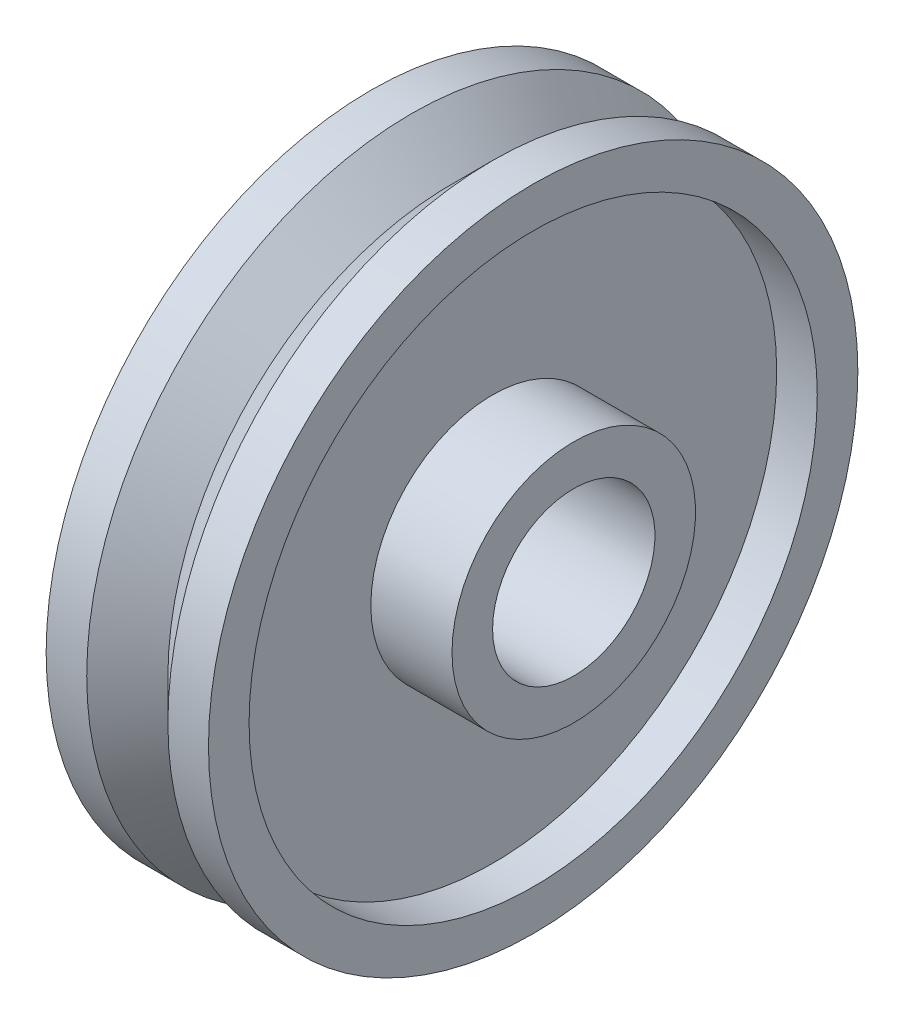
ISO-10303-21;
HEADER;
FILE_DESCRIPTION(('STEP AP214'),'2;1');
FILE_NAME('part.step','',(''),(''),'','','');
FILE_SCHEMA(('AUTOMOTIVE_DESIGN { 1 0 10303 214 1 1 1 1 }'));
ENDSEC;
DATA;
#1=APPLICATION_CONTEXT('core data for automotive mechanical design processes');
#2=APPLICATION_PROTOCOL_DEFINITION('international standard','automotive_design',2000,#1);
#3=PRODUCT_CONTEXT('',#1,'mechanical');
#4=PRODUCT('Part','Part','',(#3));
#5=PRODUCT_RELATED_PRODUCT_CATEGORY('part','',(#4));
#6=PRODUCT_DEFINITION_FORMATION('','',#4);
#7=PRODUCT_DEFINITION_CONTEXT('part definition',#1,'design');
#8=PRODUCT_DEFINITION('design','',#6,#7);
#9=PRODUCT_DEFINITION_SHAPE('','',#8);
#10=(LENGTH_UNIT() NAMED_UNIT(*) SI_UNIT(.MILLI.,.METRE.));
#11=(NAMED_UNIT(*) PLANE_ANGLE_UNIT() SI_UNIT($,.RADIAN.));
#12=(NAMED_UNIT(*) SI_UNIT($,.STERADIAN.) SOLID_ANGLE_UNIT());
#13=UNCERTAINTY_MEASURE_WITH_UNIT(LENGTH_MEASURE(1.E-05),#10,'distance_accuracy_value','');
#14=(GEOMETRIC_REPRESENTATION_CONTEXT(3) GLOBAL_UNCERTAINTY_ASSIGNED_CONTEXT((#13)) GLOBAL_UNIT_ASSIGNED_CONTEXT((#10,
#11,#12)) REPRESENTATION_CONTEXT('',''));
#15=CARTESIAN_POINT('',(0.,0.,0.));
#16=DIRECTION('',(0.,0.,1.));
#17=DIRECTION('',(1.,0.,0.));
#18=AXIS2_PLACEMENT_3D('',#15,#16,#17);
#19=CARTESIAN_POINT('',(19.05,12.7,0.));
#20=DIRECTION('',(-1.,0.,0.));
#21=DIRECTION('',(0.,0.,1.));
#22=AXIS2_PLACEMENT_3D('',#19,#20,#21);
#23=PLANE('',#22);
#24=CARTESIAN_POINT('',(19.05,0.,0.));
#25=DIRECTION('',(-1.,0.,0.));
#26=DIRECTION('',(0.,0.,1.));
#27=AXIS2_PLACEMENT_3D('',#24,#25,#26);
#28=CIRCLE('',#27,19.05);
#29=CARTESIAN_POINT('',(19.05,0.,19.05));
#30=VERTEX_POINT('',#29);
#31=EDGE_CURVE('E10',#30,#30,#28,.T.);
#32=ORIENTED_EDGE('',*,*,#31,.F.);
#33=EDGE_LOOP('',(#32));
#34=FACE_BOUND('',#33,.T.);
#35=CARTESIAN_POINT('',(19.05,0.,0.));
#36=DIRECTION('',(-1.,0.,0.));
#37=DIRECTION('',(0.,0.,1.));
#38=AXIS2_PLACEMENT_3D('',#35,#36,#37);
#39=CIRCLE('',#38,12.7);
#40=CARTESIAN_POINT('',(19.05,0.,12.7));
#41=VERTEX_POINT('',#40);
#42=EDGE_CURVE('E90',#41,#41,#39,.T.);
#43=ORIENTED_EDGE('',*,*,#42,.T.);
#44=EDGE_LOOP('',(#43));
#45=FACE_BOUND('',#44,.T.);
#46=ADVANCED_FACE('F41',(#34,#45),#23,.F.);
#47=CARTESIAN_POINT('',(-487.032527769321,0.,0.));
#48=DIRECTION('',(-1.,0.,0.));
#49=DIRECTION('',(0.,0.,1.));
#50=AXIS2_PLACEMENT_3D('',#47,#48,#49);
#51=CYLINDRICAL_SURFACE('',#50,19.05);
#52=CARTESIAN_POINT('',(6.35000000000002,0.,0.));
#53=DIRECTION('',(-1.,0.,0.));
#54=DIRECTION('',(0.,0.,1.));
#55=AXIS2_PLACEMENT_3D('',#52,#53,#54);
#56=CIRCLE('',#55,19.05);
#57=CARTESIAN_POINT('',(6.35000000000002,0.,19.05));
#58=VERTEX_POINT('',#57);
#59=EDGE_CURVE('E47',#58,#58,#56,.T.);
#60=ORIENTED_EDGE('',*,*,#59,.F.);
#61=EDGE_LOOP('',(#60));
#62=FACE_BOUND('',#61,.T.);
#63=ORIENTED_EDGE('',*,*,#31,.T.);
#64=EDGE_LOOP('',(#63));
#65=FACE_BOUND('',#64,.T.);
#66=ADVANCED_FACE('F169',(#62,#65),#51,.T.);
#67=CARTESIAN_POINT('',(6.35,19.05,0.));
#68=DIRECTION('',(-1.,0.,0.));
#69=DIRECTION('',(0.,0.,1.));
#70=AXIS2_PLACEMENT_3D('',#67,#68,#69);
#71=PLANE('',#70);
#72=CARTESIAN_POINT('',(6.35000000000002,0.,0.));
#73=DIRECTION('',(-1.,0.,0.));
#74=DIRECTION('',(0.,0.,1.));
#75=AXIS2_PLACEMENT_3D('',#72,#73,#74);
#76=CIRCLE('',#75,44.45);
#77=CARTESIAN_POINT('',(6.35000000000002,0.,44.45));
#78=VERTEX_POINT('',#77);
#79=EDGE_CURVE('E51',#78,#78,#76,.T.);
#80=ORIENTED_EDGE('',*,*,#79,.F.);
#81=EDGE_LOOP('',(#80));
#82=FACE_BOUND('',#81,.T.);
#83=ORIENTED_EDGE('',*,*,#59,.T.);
#84=EDGE_LOOP('',(#83));
#85=FACE_BOUND('',#84,.T.);
#86=ADVANCED_FACE('F164',(#82,#85),#71,.F.);
#87=CARTESIAN_POINT('',(-487.032527769321,0.,0.));
#88=DIRECTION('',(-1.,0.,0.));
#89=DIRECTION('',(0.,0.,1.));
#90=AXIS2_PLACEMENT_3D('',#87,#88,#89);
#91=CYLINDRICAL_SURFACE('',#90,44.45);
#92=CARTESIAN_POINT('',(12.7,0.,0.));
#93=DIRECTION('',(-1.,0.,0.));
#94=DIRECTION('',(0.,0.,1.));
#95=AXIS2_PLACEMENT_3D('',#92,#93,#94);
#96=CIRCLE('',#95,44.45);
#97=CARTESIAN_POINT('',(12.7,0.,44.45));
#98=VERTEX_POINT('',#97);
#99=EDGE_CURVE('E55',#98,#98,#96,.T.);
#100=ORIENTED_EDGE('',*,*,#99,.F.);
#101=EDGE_LOOP('',(#100));
#102=FACE_BOUND('',#101,.T.);
#103=ORIENTED_EDGE('',*,*,#79,.T.);
#104=EDGE_LOOP('',(#103));
#105=FACE_BOUND('',#104,.T.);
#106=ADVANCED_FACE('F158',(#102,#105),#91,.F.);
#107=CARTESIAN_POINT('',(12.7,44.45,0.));
#108=DIRECTION('',(-1.,0.,0.));
#109=DIRECTION('',(0.,0.,1.));
#110=AXIS2_PLACEMENT_3D('',#107,#108,#109);
#111=PLANE('',#110);
#112=CARTESIAN_POINT('',(12.7,0.,0.));
#113=DIRECTION('',(-1.,0.,0.));
#114=DIRECTION('',(0.,0.,1.));
#115=AXIS2_PLACEMENT_3D('',#112,#113,#114);
#116=CIRCLE('',#115,50.8);
#117=CARTESIAN_POINT('',(12.7,0.,50.8));
#118=VERTEX_POINT('',#117);
#119=EDGE_CURVE('E60',#118,#118,#116,.T.);
#120=ORIENTED_EDGE('',*,*,#119,.F.);
#121=EDGE_LOOP('',(#120));
#122=FACE_BOUND('',#121,.T.);
#123=ORIENTED_EDGE('',*,*,#99,.T.);
#124=EDGE_LOOP('',(#123));
#125=FACE_BOUND('',#124,.T.);
#126=ADVANCED_FACE('F152',(#122,#125),#111,.F.);
#127=CARTESIAN_POINT('',(-487.032527769321,0.,0.));
#128=DIRECTION('',(-1.,0.,0.));
#129=DIRECTION('',(0.,0.,1.));
#130=AXIS2_PLACEMENT_3D('',#127,#128,#129);
#131=CYLINDRICAL_SURFACE('',#130,50.8);
#132=CARTESIAN_POINT('',(6.34999999999991,0.,0.));
#133=DIRECTION('',(-1.,0.,0.));
#134=DIRECTION('',(0.,0.,1.));
#135=AXIS2_PLACEMENT_3D('',#132,#133,#134);
#136=CIRCLE('',#135,50.8);
#137=CARTESIAN_POINT('',(6.34999999999991,0.,50.8));
#138=VERTEX_POINT('',#137);
#139=EDGE_CURVE('E63',#138,#138,#136,.T.);
#140=ORIENTED_EDGE('',*,*,#139,.F.);
#141=EDGE_LOOP('',(#140));
#142=FACE_BOUND('',#141,.T.);
#143=ORIENTED_EDGE('',*,*,#119,.T.);
#144=EDGE_LOOP('',(#143));
#145=FACE_BOUND('',#144,.T.);
#146=ADVANCED_FACE('F146',(#142,#145),#131,.T.);
#147=CARTESIAN_POINT('',(6.34999999999991,0.,0.));
#148=DIRECTION('',(1.,0.,0.));
#149=DIRECTION('',(0.,0.,-1.));
#150=AXIS2_PLACEMENT_3D('',#147,#148,#149);
#151=CONICAL_SURFACE('',#150,50.8,0.785398163397455);
#152=CARTESIAN_POINT('',(0.,0.,0.));
#153=DIRECTION('',(-1.,0.,0.));
#154=DIRECTION('',(0.,0.,1.));
#155=AXIS2_PLACEMENT_3D('',#152,#153,#154);
#156=CIRCLE('',#155,44.45);
#157=CARTESIAN_POINT('',(0.,0.,44.45));
#158=VERTEX_POINT('',#157);
#159=EDGE_CURVE('E66',#158,#158,#156,.T.);
#160=ORIENTED_EDGE('',*,*,#159,.F.);
#161=EDGE_LOOP('',(#160));
#162=FACE_BOUND('',#161,.T.);
#163=ORIENTED_EDGE('',*,*,#139,.T.);
#164=EDGE_LOOP('',(#163));
#165=FACE_BOUND('',#164,.T.);
#166=ADVANCED_FACE('F140',(#162,#165),#151,.T.);
#167=CARTESIAN_POINT('',(0.,0.,0.));
#168=DIRECTION('',(-1.,0.,0.));
#169=DIRECTION('',(0.,0.,1.));
#170=AXIS2_PLACEMENT_3D('',#167,#168,#169);
#171=CONICAL_SURFACE('',#170,44.45,0.785398163397425);
#172=CARTESIAN_POINT('',(-6.3500000000003,0.,0.));
#173=DIRECTION('',(-1.,0.,0.));
#174=DIRECTION('',(0.,0.,1.));
#175=AXIS2_PLACEMENT_3D('',#172,#173,#174);
#176=CIRCLE('',#175,50.8);
#177=CARTESIAN_POINT('',(-6.3500000000003,0.,50.8));
#178=VERTEX_POINT('',#177);
#179=EDGE_CURVE('E69',#178,#178,#176,.T.);
#180=ORIENTED_EDGE('',*,*,#179,.F.);
#181=EDGE_LOOP('',(#180));
#182=FACE_BOUND('',#181,.T.);
#183=ORIENTED_EDGE('',*,*,#159,.T.);
#184=EDGE_LOOP('',(#183));
#185=FACE_BOUND('',#184,.T.);
#186=ADVANCED_FACE('F134',(#182,#185),#171,.T.);
#187=CARTESIAN_POINT('',(-487.032527769321,0.,0.));
#188=DIRECTION('',(-1.,0.,0.));
#189=DIRECTION('',(0.,0.,1.));
#190=AXIS2_PLACEMENT_3D('',#187,#188,#189);
#191=CYLINDRICAL_SURFACE('',#190,50.8);
#192=CARTESIAN_POINT('',(-12.7000000000003,0.,0.));
#193=DIRECTION('',(-1.,0.,0.));
#194=DIRECTION('',(0.,0.,1.));
#195=AXIS2_PLACEMENT_3D('',#192,#193,#194);
#196=CIRCLE('',#195,50.8);
#197=CARTESIAN_POINT('',(-12.7000000000003,0.,50.8));
#198=VERTEX_POINT('',#197);
#199=EDGE_CURVE('E72',#198,#198,#196,.T.);
#200=ORIENTED_EDGE('',*,*,#199,.F.);
#201=EDGE_LOOP('',(#200));
#202=FACE_BOUND('',#201,.T.);
#203=ORIENTED_EDGE('',*,*,#179,.T.);
#204=EDGE_LOOP('',(#203));
#205=FACE_BOUND('',#204,.T.);
#206=ADVANCED_FACE('F128',(#202,#205),#191,.T.);
#207=CARTESIAN_POINT('',(-12.7000000000003,44.45,0.));
#208=DIRECTION('',(1.,0.,0.));
#209=DIRECTION('',(0.,0.,-1.));
#210=AXIS2_PLACEMENT_3D('',#207,#208,#209);
#211=PLANE('',#210);
#212=CARTESIAN_POINT('',(-12.7000000000003,0.,0.));
#213=DIRECTION('',(-1.,0.,0.));
#214=DIRECTION('',(0.,0.,1.));
#215=AXIS2_PLACEMENT_3D('',#212,#213,#214);
#216=CIRCLE('',#215,44.45);
#217=CARTESIAN_POINT('',(-12.7000000000003,0.,44.45));
#218=VERTEX_POINT('',#217);
#219=EDGE_CURVE('E75',#218,#218,#216,.T.);
#220=ORIENTED_EDGE('',*,*,#219,.F.);
#221=EDGE_LOOP('',(#220));
#222=FACE_BOUND('',#221,.T.);
#223=ORIENTED_EDGE('',*,*,#199,.T.);
#224=EDGE_LOOP('',(#223));
#225=FACE_BOUND('',#224,.T.);
#226=ADVANCED_FACE('F122',(#222,#225),#211,.F.);
#227=CARTESIAN_POINT('',(-487.032527769321,0.,0.));
#228=DIRECTION('',(-1.,0.,0.));
#229=DIRECTION('',(0.,0.,1.));
#230=AXIS2_PLACEMENT_3D('',#227,#228,#229);
#231=CYLINDRICAL_SURFACE('',#230,44.45);
#232=CARTESIAN_POINT('',(-6.3500000000003,0.,0.));
#233=DIRECTION('',(-1.,0.,0.));
#234=DIRECTION('',(0.,0.,1.));
#235=AXIS2_PLACEMENT_3D('',#232,#233,#234);
#236=CIRCLE('',#235,44.45);
#237=CARTESIAN_POINT('',(-6.3500000000003,0.,44.45));
#238=VERTEX_POINT('',#237);
#239=EDGE_CURVE('E78',#238,#238,#236,.T.);
#240=ORIENTED_EDGE('',*,*,#239,.F.);
#241=EDGE_LOOP('',(#240));
#242=FACE_BOUND('',#241,.T.);
#243=ORIENTED_EDGE('',*,*,#219,.T.);
#244=EDGE_LOOP('',(#243));
#245=FACE_BOUND('',#244,.T.);
#246=ADVANCED_FACE('F116',(#242,#245),#231,.F.);
#247=CARTESIAN_POINT('',(-6.35000000000022,19.05,0.));
#248=DIRECTION('',(1.,0.,0.));
#249=DIRECTION('',(0.,0.,-1.));
#250=AXIS2_PLACEMENT_3D('',#247,#248,#249);
#251=PLANE('',#250);
#252=CARTESIAN_POINT('',(-6.35000000000013,0.,0.));
#253=DIRECTION('',(-1.,0.,0.));
#254=DIRECTION('',(0.,0.,1.));
#255=AXIS2_PLACEMENT_3D('',#252,#253,#254);
#256=CIRCLE('',#255,19.05);
#257=CARTESIAN_POINT('',(-6.35000000000013,0.,19.05));
#258=VERTEX_POINT('',#257);
#259=EDGE_CURVE('E81',#258,#258,#256,.T.);
#260=ORIENTED_EDGE('',*,*,#259,.F.);
#261=EDGE_LOOP('',(#260));
#262=FACE_BOUND('',#261,.T.);
#263=ORIENTED_EDGE('',*,*,#239,.T.);
#264=EDGE_LOOP('',(#263));
#265=FACE_BOUND('',#264,.T.);
#266=ADVANCED_FACE('F110',(#262,#265),#251,.F.);
#267=CARTESIAN_POINT('',(-487.032527769321,0.,0.));
#268=DIRECTION('',(-1.,0.,0.));
#269=DIRECTION('',(0.,0.,1.));
#270=AXIS2_PLACEMENT_3D('',#267,#268,#269);
#271=CYLINDRICAL_SURFACE('',#270,19.0499999999999);
#272=CARTESIAN_POINT('',(-19.0500000000001,0.,0.));
#273=DIRECTION('',(-1.,0.,0.));
#274=DIRECTION('',(0.,0.,1.));
#275=AXIS2_PLACEMENT_3D('',#272,#273,#274);
#276=CIRCLE('',#275,19.0499999999998);
#277=CARTESIAN_POINT('',(-19.0500000000001,0.,19.0499999999998));
#278=VERTEX_POINT('',#277);
#279=EDGE_CURVE('E84',#278,#278,#276,.T.);
#280=ORIENTED_EDGE('',*,*,#279,.F.);
#281=EDGE_LOOP('',(#280));
#282=FACE_BOUND('',#281,.T.);
#283=ORIENTED_EDGE('',*,*,#259,.T.);
#284=EDGE_LOOP('',(#283));
#285=FACE_BOUND('',#284,.T.);
#286=ADVANCED_FACE('F104',(#282,#285),#271,.T.);
#287=CARTESIAN_POINT('',(-19.0500000000001,12.6999999999999,0.));
#288=DIRECTION('',(1.,0.,0.));
#289=DIRECTION('',(0.,0.,-1.));
#290=AXIS2_PLACEMENT_3D('',#287,#288,#289);
#291=PLANE('',#290);
#292=CARTESIAN_POINT('',(-19.0500000000001,0.,0.));
#293=DIRECTION('',(-1.,0.,0.));
#294=DIRECTION('',(0.,0.,1.));
#295=AXIS2_PLACEMENT_3D('',#292,#293,#294);
#296=CIRCLE('',#295,12.6999999999999);
#297=CARTESIAN_POINT('',(-19.0500000000001,0.,12.6999999999999));
#298=VERTEX_POINT('',#297);
#299=EDGE_CURVE('E87',#298,#298,#296,.T.);
#300=ORIENTED_EDGE('',*,*,#299,.F.);
#301=EDGE_LOOP('',(#300));
#302=FACE_BOUND('',#301,.T.);
#303=ORIENTED_EDGE('',*,*,#279,.T.);
#304=EDGE_LOOP('',(#303));
#305=FACE_BOUND('',#304,.T.);
#306=ADVANCED_FACE('F98',(#302,#305),#291,.F.);
#307=CARTESIAN_POINT('',(-487.032527769321,0.,0.));
#308=DIRECTION('',(-1.,0.,0.));
#309=DIRECTION('',(0.,0.,1.));
#310=AXIS2_PLACEMENT_3D('',#307,#308,#309);
#311=CYLINDRICAL_SURFACE('',#310,12.6999999999999);
#312=ORIENTED_EDGE('',*,*,#42,.F.);
#313=EDGE_LOOP('',(#312));
#314=FACE_BOUND('',#313,.T.);
#315=ORIENTED_EDGE('',*,*,#299,.T.);
#316=EDGE_LOOP('',(#315));
#317=FACE_BOUND('',#316,.T.);
#318=ADVANCED_FACE('F95',(#314,#317),#311,.F.);
#319=CLOSED_SHELL('',(#46,#66,#86,#106,#126,#146,#166,#186,#206,#226,#246,#266,#286,#306,#318));
#320=MANIFOLD_SOLID_BREP('B2',#319);
#321=ADVANCED_BREP_SHAPE_REPRESENTATION('',(#18,#320),#14);
#322=SHAPE_DEFINITION_REPRESENTATION(#9,#321);
ENDSEC;
END-ISO-10303-21;
